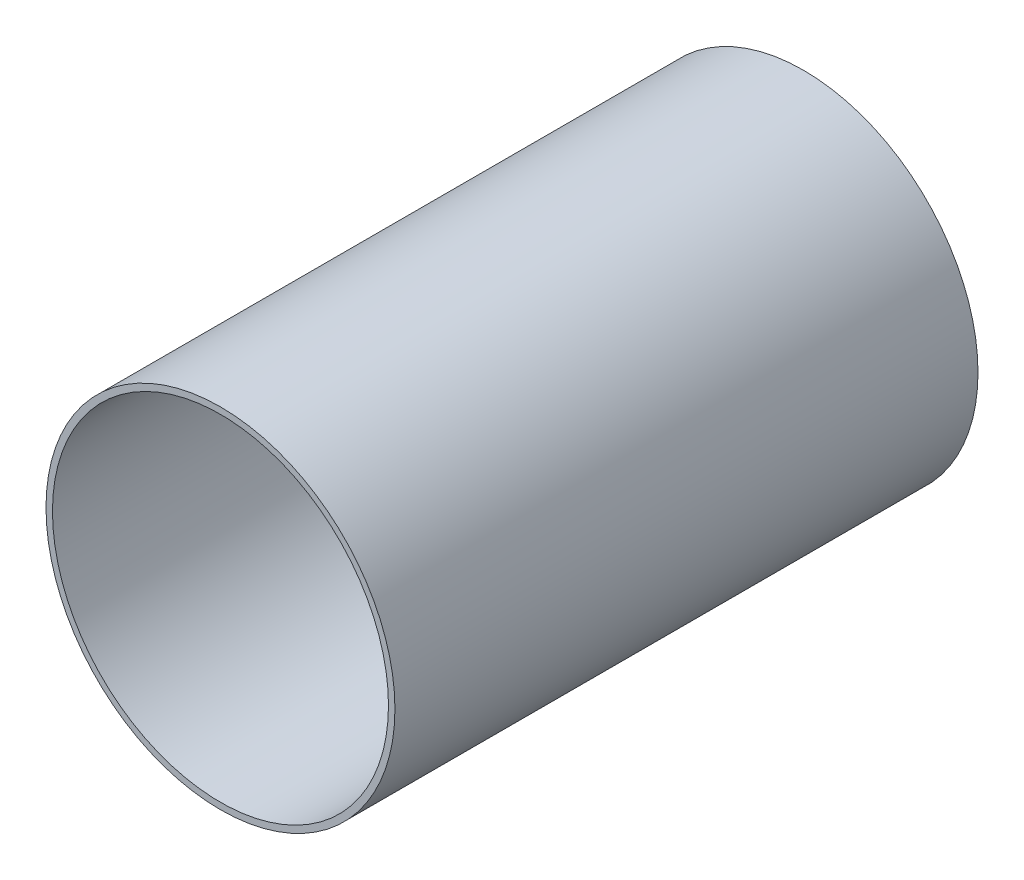
ISO-10303-21;
HEADER;
FILE_DESCRIPTION(('STEP AP214'),'2;1');
FILE_NAME('part.step','',(''),(''),'','','');
FILE_SCHEMA(('AUTOMOTIVE_DESIGN { 1 0 10303 214 1 1 1 1 }'));
ENDSEC;
DATA;
#1=APPLICATION_CONTEXT('core data for automotive mechanical design processes');
#2=APPLICATION_PROTOCOL_DEFINITION('international standard','automotive_design',2000,#1);
#3=PRODUCT_CONTEXT('',#1,'mechanical');
#4=PRODUCT('Part','Part','',(#3));
#5=PRODUCT_RELATED_PRODUCT_CATEGORY('part','',(#4));
#6=PRODUCT_DEFINITION_FORMATION('','',#4);
#7=PRODUCT_DEFINITION_CONTEXT('part definition',#1,'design');
#8=PRODUCT_DEFINITION('design','',#6,#7);
#9=PRODUCT_DEFINITION_SHAPE('','',#8);
#10=(LENGTH_UNIT() NAMED_UNIT(*) SI_UNIT(.MILLI.,.METRE.));
#11=(NAMED_UNIT(*) PLANE_ANGLE_UNIT() SI_UNIT($,.RADIAN.));
#12=(NAMED_UNIT(*) SI_UNIT($,.STERADIAN.) SOLID_ANGLE_UNIT());
#13=UNCERTAINTY_MEASURE_WITH_UNIT(LENGTH_MEASURE(1.E-05),#10,'distance_accuracy_value','');
#14=(GEOMETRIC_REPRESENTATION_CONTEXT(3) GLOBAL_UNCERTAINTY_ASSIGNED_CONTEXT((#13)) GLOBAL_UNIT_ASSIGNED_CONTEXT((#10,
#11,#12)) REPRESENTATION_CONTEXT('',''));
#15=CARTESIAN_POINT('',(0.,0.,0.));
#16=DIRECTION('',(0.,0.,1.));
#17=DIRECTION('',(1.,0.,0.));
#18=AXIS2_PLACEMENT_3D('',#15,#16,#17);
#19=CARTESIAN_POINT('',(0.,0.,165.1));
#20=DIRECTION('',(0.,0.,1.));
#21=DIRECTION('',(1.,0.,0.));
#22=AXIS2_PLACEMENT_3D('',#19,#20,#21);
#23=PLANE('',#22);
#24=CARTESIAN_POINT('',(0.,0.,165.1));
#25=DIRECTION('',(0.,0.,1.));
#26=DIRECTION('',(1.,0.,0.));
#27=AXIS2_PLACEMENT_3D('',#24,#25,#26);
#28=CIRCLE('',#27,49.403);
#29=CARTESIAN_POINT('',(49.403,0.,165.1));
#30=VERTEX_POINT('',#29);
#31=EDGE_CURVE('E10',#30,#30,#28,.T.);
#32=ORIENTED_EDGE('',*,*,#31,.T.);
#33=EDGE_LOOP('',(#32));
#34=FACE_BOUND('',#33,.T.);
#35=CARTESIAN_POINT('',(0.,0.,165.1));
#36=DIRECTION('',(0.,0.,1.));
#37=DIRECTION('',(1.,0.,0.));
#38=AXIS2_PLACEMENT_3D('',#35,#36,#37);
#39=CIRCLE('',#38,47.5742);
#40=CARTESIAN_POINT('',(47.5742,0.,165.1));
#41=VERTEX_POINT('',#40);
#42=EDGE_CURVE('E46',#41,#41,#39,.T.);
#43=ORIENTED_EDGE('',*,*,#42,.F.);
#44=EDGE_LOOP('',(#43));
#45=FACE_BOUND('',#44,.T.);
#46=ADVANCED_FACE('F35',(#34,#45),#23,.T.);
#47=CARTESIAN_POINT('',(0.,0.,0.));
#48=DIRECTION('',(0.,0.,1.));
#49=DIRECTION('',(1.,0.,0.));
#50=AXIS2_PLACEMENT_3D('',#47,#48,#49);
#51=PLANE('',#50);
#52=CARTESIAN_POINT('',(0.,0.,0.));
#53=DIRECTION('',(0.,0.,1.));
#54=DIRECTION('',(1.,0.,0.));
#55=AXIS2_PLACEMENT_3D('',#52,#53,#54);
#56=CIRCLE('',#55,49.403);
#57=CARTESIAN_POINT('',(49.403,0.,0.));
#58=VERTEX_POINT('',#57);
#59=EDGE_CURVE('E39',#58,#58,#56,.T.);
#60=ORIENTED_EDGE('',*,*,#59,.F.);
#61=EDGE_LOOP('',(#60));
#62=FACE_BOUND('',#61,.T.);
#63=CARTESIAN_POINT('',(0.,0.,0.));
#64=DIRECTION('',(0.,0.,1.));
#65=DIRECTION('',(1.,0.,0.));
#66=AXIS2_PLACEMENT_3D('',#63,#64,#65);
#67=CIRCLE('',#66,47.5742);
#68=CARTESIAN_POINT('',(47.5742,0.,0.));
#69=VERTEX_POINT('',#68);
#70=EDGE_CURVE('E48',#69,#69,#67,.T.);
#71=ORIENTED_EDGE('',*,*,#70,.T.);
#72=EDGE_LOOP('',(#71));
#73=FACE_BOUND('',#72,.T.);
#74=ADVANCED_FACE('F58',(#62,#73),#51,.F.);
#75=CARTESIAN_POINT('',(0.,0.,165.1));
#76=DIRECTION('',(0.,0.,-1.));
#77=DIRECTION('',(-1.,0.,0.));
#78=AXIS2_PLACEMENT_3D('',#75,#76,#77);
#79=CYLINDRICAL_SURFACE('',#78,49.403);
#80=ORIENTED_EDGE('',*,*,#31,.F.);
#81=EDGE_LOOP('',(#80));
#82=FACE_BOUND('',#81,.T.);
#83=ORIENTED_EDGE('',*,*,#59,.T.);
#84=EDGE_LOOP('',(#83));
#85=FACE_BOUND('',#84,.T.);
#86=ADVANCED_FACE('F37',(#82,#85),#79,.T.);
#87=CARTESIAN_POINT('',(0.,0.,165.1));
#88=DIRECTION('',(0.,0.,-1.));
#89=DIRECTION('',(-1.,0.,0.));
#90=AXIS2_PLACEMENT_3D('',#87,#88,#89);
#91=CYLINDRICAL_SURFACE('',#90,47.5742);
#92=ORIENTED_EDGE('',*,*,#42,.T.);
#93=EDGE_LOOP('',(#92));
#94=FACE_BOUND('',#93,.T.);
#95=ORIENTED_EDGE('',*,*,#70,.F.);
#96=EDGE_LOOP('',(#95));
#97=FACE_BOUND('',#96,.T.);
#98=ADVANCED_FACE('F54',(#94,#97),#91,.F.);
#99=CLOSED_SHELL('',(#46,#74,#86,#98));
#100=MANIFOLD_SOLID_BREP('B2',#99);
#101=ADVANCED_BREP_SHAPE_REPRESENTATION('',(#18,#100),#14);
#102=SHAPE_DEFINITION_REPRESENTATION(#9,#101);
ENDSEC;
END-ISO-10303-21;
